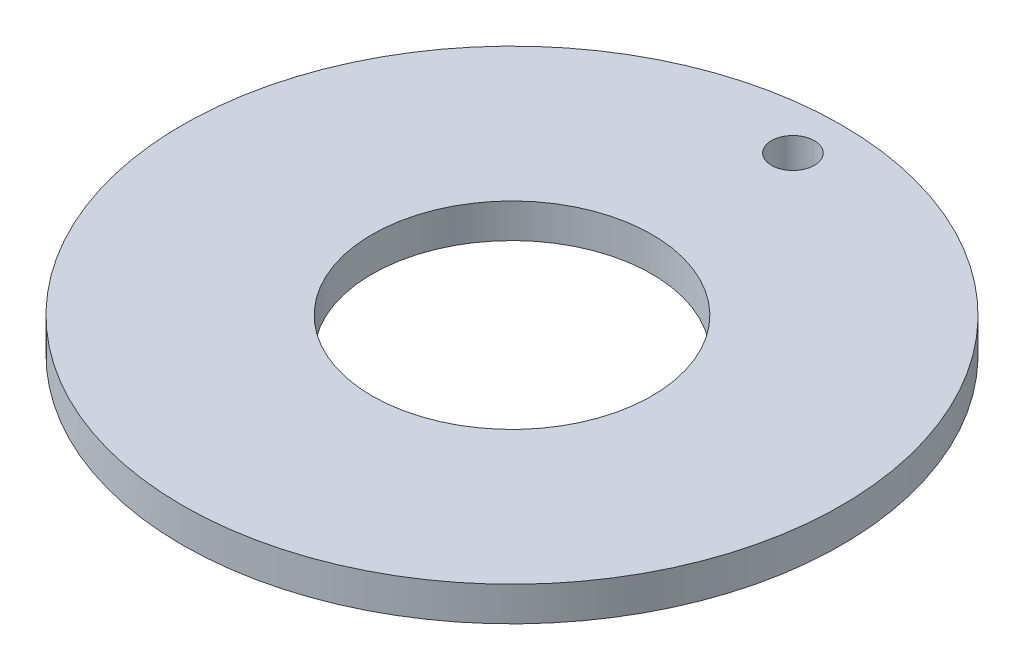
ISO-10303-21;
HEADER;
FILE_DESCRIPTION(('STEP AP214'),'2;1');
FILE_NAME('part.step','',(''),(''),'','','');
FILE_SCHEMA(('AUTOMOTIVE_DESIGN { 1 0 10303 214 1 1 1 1 }'));
ENDSEC;
DATA;
#1=APPLICATION_CONTEXT('core data for automotive mechanical design processes');
#2=APPLICATION_PROTOCOL_DEFINITION('international standard','automotive_design',2000,#1);
#3=PRODUCT_CONTEXT('',#1,'mechanical');
#4=PRODUCT('Part','Part','',(#3));
#5=PRODUCT_RELATED_PRODUCT_CATEGORY('part','',(#4));
#6=PRODUCT_DEFINITION_FORMATION('','',#4);
#7=PRODUCT_DEFINITION_CONTEXT('part definition',#1,'design');
#8=PRODUCT_DEFINITION('design','',#6,#7);
#9=PRODUCT_DEFINITION_SHAPE('','',#8);
#10=(LENGTH_UNIT() NAMED_UNIT(*) SI_UNIT(.MILLI.,.METRE.));
#11=(NAMED_UNIT(*) PLANE_ANGLE_UNIT() SI_UNIT($,.RADIAN.));
#12=(NAMED_UNIT(*) SI_UNIT($,.STERADIAN.) SOLID_ANGLE_UNIT());
#13=UNCERTAINTY_MEASURE_WITH_UNIT(LENGTH_MEASURE(1.E-05),#10,'distance_accuracy_value','');
#14=(GEOMETRIC_REPRESENTATION_CONTEXT(3) GLOBAL_UNCERTAINTY_ASSIGNED_CONTEXT((#13)) GLOBAL_UNIT_ASSIGNED_CONTEXT((#10,
#11,#12)) REPRESENTATION_CONTEXT('',''));
#15=CARTESIAN_POINT('',(0.,0.,0.));
#16=DIRECTION('',(0.,0.,1.));
#17=DIRECTION('',(1.,0.,0.));
#18=AXIS2_PLACEMENT_3D('',#15,#16,#17);
#19=CARTESIAN_POINT('',(0.,6.34999999999999,0.));
#20=DIRECTION('',(0.,1.,0.));
#21=DIRECTION('',(0.,0.,1.));
#22=AXIS2_PLACEMENT_3D('',#19,#20,#21);
#23=PLANE('',#22);
#24=CARTESIAN_POINT('',(0.,6.34999999999999,-52.));
#25=DIRECTION('',(0.,1.,0.));
#26=DIRECTION('',(0.,0.,1.));
#27=AXIS2_PLACEMENT_3D('',#24,#25,#26);
#28=CIRCLE('',#27,3.96875);
#29=CARTESIAN_POINT('',(0.,6.34999999999999,-48.03125));
#30=VERTEX_POINT('',#29);
#31=EDGE_CURVE('E53',#30,#30,#28,.T.);
#32=ORIENTED_EDGE('',*,*,#31,.F.);
#33=EDGE_LOOP('',(#32));
#34=FACE_BOUND('',#33,.T.);
#35=CARTESIAN_POINT('',(0.,6.34999999999999,0.));
#36=DIRECTION('',(0.,1.,0.));
#37=DIRECTION('',(0.,0.,1.));
#38=AXIS2_PLACEMENT_3D('',#35,#36,#37);
#39=CIRCLE('',#38,61.);
#40=CARTESIAN_POINT('',(0.,6.34999999999999,61.));
#41=VERTEX_POINT('',#40);
#42=EDGE_CURVE('E10',#41,#41,#39,.T.);
#43=ORIENTED_EDGE('',*,*,#42,.T.);
#44=EDGE_LOOP('',(#43));
#45=FACE_BOUND('',#44,.T.);
#46=CARTESIAN_POINT('',(0.,6.34999999999999,0.));
#47=DIRECTION('',(0.,1.,0.));
#48=DIRECTION('',(0.,0.,1.));
#49=AXIS2_PLACEMENT_3D('',#46,#47,#48);
#50=CIRCLE('',#49,25.9);
#51=CARTESIAN_POINT('',(0.,6.34999999999999,25.9));
#52=VERTEX_POINT('',#51);
#53=EDGE_CURVE('E43',#52,#52,#50,.T.);
#54=ORIENTED_EDGE('',*,*,#53,.F.);
#55=EDGE_LOOP('',(#54));
#56=FACE_BOUND('',#55,.T.);
#57=ADVANCED_FACE('F32',(#34,#45,#56),#23,.T.);
#58=CARTESIAN_POINT('',(0.,0.,0.));
#59=DIRECTION('',(0.,1.,0.));
#60=DIRECTION('',(0.,0.,1.));
#61=AXIS2_PLACEMENT_3D('',#58,#59,#60);
#62=PLANE('',#61);
#63=CARTESIAN_POINT('',(0.,0.,-52.));
#64=DIRECTION('',(0.,1.,0.));
#65=DIRECTION('',(0.,0.,1.));
#66=AXIS2_PLACEMENT_3D('',#63,#64,#65);
#67=CIRCLE('',#66,3.96875);
#68=CARTESIAN_POINT('',(0.,0.,-48.03125));
#69=VERTEX_POINT('',#68);
#70=EDGE_CURVE('E48',#69,#69,#67,.T.);
#71=ORIENTED_EDGE('',*,*,#70,.T.);
#72=EDGE_LOOP('',(#71));
#73=FACE_BOUND('',#72,.T.);
#74=CARTESIAN_POINT('',(0.,0.,0.));
#75=DIRECTION('',(0.,1.,0.));
#76=DIRECTION('',(0.,0.,1.));
#77=AXIS2_PLACEMENT_3D('',#74,#75,#76);
#78=CIRCLE('',#77,61.);
#79=CARTESIAN_POINT('',(0.,0.,61.));
#80=VERTEX_POINT('',#79);
#81=EDGE_CURVE('E36',#80,#80,#78,.T.);
#82=ORIENTED_EDGE('',*,*,#81,.F.);
#83=EDGE_LOOP('',(#82));
#84=FACE_BOUND('',#83,.T.);
#85=CARTESIAN_POINT('',(0.,0.,0.));
#86=DIRECTION('',(0.,1.,0.));
#87=DIRECTION('',(0.,0.,1.));
#88=AXIS2_PLACEMENT_3D('',#85,#86,#87);
#89=CIRCLE('',#88,25.9);
#90=CARTESIAN_POINT('',(0.,0.,25.9));
#91=VERTEX_POINT('',#90);
#92=EDGE_CURVE('E45',#91,#91,#89,.T.);
#93=ORIENTED_EDGE('',*,*,#92,.T.);
#94=EDGE_LOOP('',(#93));
#95=FACE_BOUND('',#94,.T.);
#96=ADVANCED_FACE('F60',(#73,#84,#95),#62,.F.);
#97=CARTESIAN_POINT('',(0.,6.34999999999999,0.));
#98=DIRECTION('',(0.,-1.,0.));
#99=DIRECTION('',(0.,0.,-1.));
#100=AXIS2_PLACEMENT_3D('',#97,#98,#99);
#101=CYLINDRICAL_SURFACE('',#100,61.);
#102=ORIENTED_EDGE('',*,*,#42,.F.);
#103=EDGE_LOOP('',(#102));
#104=FACE_BOUND('',#103,.T.);
#105=ORIENTED_EDGE('',*,*,#81,.T.);
#106=EDGE_LOOP('',(#105));
#107=FACE_BOUND('',#106,.T.);
#108=ADVANCED_FACE('F34',(#104,#107),#101,.T.);
#109=CARTESIAN_POINT('',(0.,6.34999999999999,0.));
#110=DIRECTION('',(0.,-1.,0.));
#111=DIRECTION('',(0.,0.,-1.));
#112=AXIS2_PLACEMENT_3D('',#109,#110,#111);
#113=CYLINDRICAL_SURFACE('',#112,25.9);
#114=ORIENTED_EDGE('',*,*,#53,.T.);
#115=EDGE_LOOP('',(#114));
#116=FACE_BOUND('',#115,.T.);
#117=ORIENTED_EDGE('',*,*,#92,.F.);
#118=EDGE_LOOP('',(#117));
#119=FACE_BOUND('',#118,.T.);
#120=ADVANCED_FACE('F65',(#116,#119),#113,.F.);
#121=CARTESIAN_POINT('',(0.,6.34999999999999,-52.));
#122=DIRECTION('',(0.,1.,0.));
#123=DIRECTION('',(0.,0.,1.));
#124=AXIS2_PLACEMENT_3D('',#121,#122,#123);
#125=CYLINDRICAL_SURFACE('',#124,3.96875);
#126=ORIENTED_EDGE('',*,*,#70,.F.);
#127=EDGE_LOOP('',(#126));
#128=FACE_BOUND('',#127,.T.);
#129=ORIENTED_EDGE('',*,*,#31,.T.);
#130=EDGE_LOOP('',(#129));
#131=FACE_BOUND('',#130,.T.);
#132=ADVANCED_FACE('F57',(#128,#131),#125,.F.);
#133=CLOSED_SHELL('',(#57,#96,#108,#120,#132));
#134=MANIFOLD_SOLID_BREP('B2',#133);
#135=ADVANCED_BREP_SHAPE_REPRESENTATION('',(#18,#134),#14);
#136=SHAPE_DEFINITION_REPRESENTATION(#9,#135);
ENDSEC;
END-ISO-10303-21;
